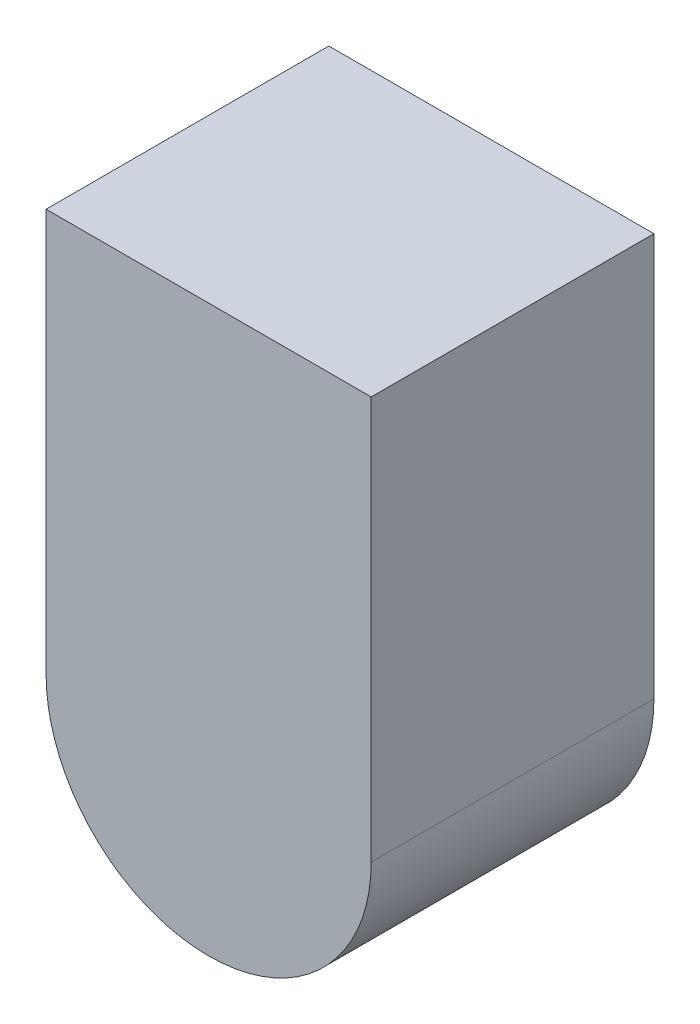
ISO-10303-21;
HEADER;
FILE_DESCRIPTION(('STEP AP214'),'2;1');
FILE_NAME('part.step','',(''),(''),'','','');
FILE_SCHEMA(('AUTOMOTIVE_DESIGN { 1 0 10303 214 1 1 1 1 }'));
ENDSEC;
DATA;
#1=APPLICATION_CONTEXT('core data for automotive mechanical design processes');
#2=APPLICATION_PROTOCOL_DEFINITION('international standard','automotive_design',2000,#1);
#3=PRODUCT_CONTEXT('',#1,'mechanical');
#4=PRODUCT('Part','Part','',(#3));
#5=PRODUCT_RELATED_PRODUCT_CATEGORY('part','',(#4));
#6=PRODUCT_DEFINITION_FORMATION('','',#4);
#7=PRODUCT_DEFINITION_CONTEXT('part definition',#1,'design');
#8=PRODUCT_DEFINITION('design','',#6,#7);
#9=PRODUCT_DEFINITION_SHAPE('','',#8);
#10=(LENGTH_UNIT() NAMED_UNIT(*) SI_UNIT(.MILLI.,.METRE.));
#11=(NAMED_UNIT(*) PLANE_ANGLE_UNIT() SI_UNIT($,.RADIAN.));
#12=(NAMED_UNIT(*) SI_UNIT($,.STERADIAN.) SOLID_ANGLE_UNIT());
#13=UNCERTAINTY_MEASURE_WITH_UNIT(LENGTH_MEASURE(1.E-05),#10,'distance_accuracy_value','');
#14=(GEOMETRIC_REPRESENTATION_CONTEXT(3) GLOBAL_UNCERTAINTY_ASSIGNED_CONTEXT((#13)) GLOBAL_UNIT_ASSIGNED_CONTEXT((#10,
#11,#12)) REPRESENTATION_CONTEXT('',''));
#15=CARTESIAN_POINT('',(0.,0.,0.));
#16=DIRECTION('',(0.,0.,1.));
#17=DIRECTION('',(1.,0.,0.));
#18=AXIS2_PLACEMENT_3D('',#15,#16,#17);
#19=CARTESIAN_POINT('',(-0.249999999999999,2.8335265642716,0.));
#20=DIRECTION('',(0.,0.,1.));
#21=DIRECTION('',(0.,-1.,0.));
#22=AXIS2_PLACEMENT_3D('',#19,#20,#21);
#23=PLANE('',#22);
#24=DIRECTION('',(-1.,0.,0.));
#25=VECTOR('',#24,1.);
#26=CARTESIAN_POINT('',(-0.134999999999999,3.,0.));
#27=LINE('',#26,#25);
#28=CARTESIAN_POINT('',(-0.134999999999999,3.,0.));
#29=VERTEX_POINT('',#28);
#30=CARTESIAN_POINT('',(-0.364999999999999,3.,0.));
#31=VERTEX_POINT('',#30);
#32=EDGE_CURVE('E11',#29,#31,#27,.T.);
#33=ORIENTED_EDGE('',*,*,#32,.F.);
#34=DIRECTION('',(0.,1.,0.));
#35=VECTOR('',#34,1.);
#36=CARTESIAN_POINT('',(-0.134999999999999,2.715,0.));
#37=LINE('',#36,#35);
#38=CARTESIAN_POINT('',(-0.134999999999999,2.715,0.));
#39=VERTEX_POINT('',#38);
#40=EDGE_CURVE('E24',#39,#29,#37,.T.);
#41=ORIENTED_EDGE('',*,*,#40,.F.);
#42=CARTESIAN_POINT('',(-0.249999999999999,2.715,0.));
#43=DIRECTION('',(0.,0.,1.));
#44=DIRECTION('',(-1.,0.,0.));
#45=AXIS2_PLACEMENT_3D('',#42,#43,#44);
#46=CIRCLE('',#45,0.115);
#47=CARTESIAN_POINT('',(-0.364999999999999,2.715,0.));
#48=VERTEX_POINT('',#47);
#49=EDGE_CURVE('E85',#48,#39,#46,.T.);
#50=ORIENTED_EDGE('',*,*,#49,.F.);
#51=DIRECTION('',(0.,-1.,0.));
#52=VECTOR('',#51,1.);
#53=CARTESIAN_POINT('',(-0.364999999999999,3.,0.));
#54=LINE('',#53,#52);
#55=EDGE_CURVE('E82',#31,#48,#54,.T.);
#56=ORIENTED_EDGE('',*,*,#55,.F.);
#57=EDGE_LOOP('',(#33,#41,#50,#56));
#58=FACE_BOUND('',#57,.T.);
#59=ADVANCED_FACE('F17',(#58),#23,.F.);
#60=CARTESIAN_POINT('',(-0.364999999999999,3.,0.));
#61=DIRECTION('',(-1.,0.,0.));
#62=DIRECTION('',(0.,-1.,0.));
#63=AXIS2_PLACEMENT_3D('',#60,#61,#62);
#64=PLANE('',#63);
#65=ORIENTED_EDGE('',*,*,#55,.T.);
#66=DIRECTION('',(0.,0.,1.));
#67=VECTOR('',#66,1.);
#68=CARTESIAN_POINT('',(-0.364999999999999,2.715,0.));
#69=LINE('',#68,#67);
#70=CARTESIAN_POINT('',(-0.364999999999999,2.715,0.2));
#71=VERTEX_POINT('',#70);
#72=EDGE_CURVE('E80',#48,#71,#69,.T.);
#73=ORIENTED_EDGE('',*,*,#72,.T.);
#74=DIRECTION('',(0.,-1.,0.));
#75=VECTOR('',#74,1.);
#76=CARTESIAN_POINT('',(-0.364999999999999,3.,0.2));
#77=LINE('',#76,#75);
#78=CARTESIAN_POINT('',(-0.364999999999999,3.,0.2));
#79=VERTEX_POINT('',#78);
#80=EDGE_CURVE('E78',#79,#71,#77,.T.);
#81=ORIENTED_EDGE('',*,*,#80,.F.);
#82=DIRECTION('',(0.,0.,-1.));
#83=VECTOR('',#82,1.);
#84=CARTESIAN_POINT('',(-0.364999999999999,3.,0.));
#85=LINE('',#84,#83);
#86=EDGE_CURVE('E71',#79,#31,#85,.T.);
#87=ORIENTED_EDGE('',*,*,#86,.T.);
#88=EDGE_LOOP('',(#65,#73,#81,#87));
#89=FACE_BOUND('',#88,.T.);
#90=ADVANCED_FACE('F91',(#89),#64,.T.);
#91=CARTESIAN_POINT('',(-0.249999999999999,2.715,0.));
#92=DIRECTION('',(0.,0.,1.));
#93=DIRECTION('',(-1.,0.,0.));
#94=AXIS2_PLACEMENT_3D('',#91,#92,#93);
#95=CYLINDRICAL_SURFACE('',#94,0.115);
#96=ORIENTED_EDGE('',*,*,#49,.T.);
#97=DIRECTION('',(0.,0.,1.));
#98=VECTOR('',#97,1.);
#99=CARTESIAN_POINT('',(-0.134999999999999,2.715,0.));
#100=LINE('',#99,#98);
#101=CARTESIAN_POINT('',(-0.134999999999999,2.715,0.2));
#102=VERTEX_POINT('',#101);
#103=EDGE_CURVE('E75',#39,#102,#100,.T.);
#104=ORIENTED_EDGE('',*,*,#103,.T.);
#105=CARTESIAN_POINT('',(-0.249999999999999,2.715,0.2));
#106=DIRECTION('',(0.,0.,1.));
#107=DIRECTION('',(-1.,0.,0.));
#108=AXIS2_PLACEMENT_3D('',#105,#106,#107);
#109=CIRCLE('',#108,0.115);
#110=EDGE_CURVE('E59',#71,#102,#109,.T.);
#111=ORIENTED_EDGE('',*,*,#110,.F.);
#112=ORIENTED_EDGE('',*,*,#72,.F.);
#113=EDGE_LOOP('',(#96,#104,#111,#112));
#114=FACE_BOUND('',#113,.T.);
#115=ADVANCED_FACE('F89',(#114),#95,.T.);
#116=CARTESIAN_POINT('',(-0.134999999999999,2.715,0.));
#117=DIRECTION('',(1.,0.,0.));
#118=DIRECTION('',(0.,1.,0.));
#119=AXIS2_PLACEMENT_3D('',#116,#117,#118);
#120=PLANE('',#119);
#121=ORIENTED_EDGE('',*,*,#40,.T.);
#122=DIRECTION('',(0.,0.,1.));
#123=VECTOR('',#122,1.);
#124=CARTESIAN_POINT('',(-0.134999999999999,3.,0.));
#125=LINE('',#124,#123);
#126=CARTESIAN_POINT('',(-0.134999999999999,3.,0.2));
#127=VERTEX_POINT('',#126);
#128=EDGE_CURVE('E53',#29,#127,#125,.T.);
#129=ORIENTED_EDGE('',*,*,#128,.T.);
#130=DIRECTION('',(0.,1.,0.));
#131=VECTOR('',#130,1.);
#132=CARTESIAN_POINT('',(-0.134999999999999,2.715,0.2));
#133=LINE('',#132,#131);
#134=EDGE_CURVE('E57',#102,#127,#133,.T.);
#135=ORIENTED_EDGE('',*,*,#134,.F.);
#136=ORIENTED_EDGE('',*,*,#103,.F.);
#137=EDGE_LOOP('',(#121,#129,#135,#136));
#138=FACE_BOUND('',#137,.T.);
#139=ADVANCED_FACE('F55',(#138),#120,.T.);
#140=CARTESIAN_POINT('',(3.,3.,0.));
#141=DIRECTION('',(0.,1.,0.));
#142=DIRECTION('',(-1.,0.,0.));
#143=AXIS2_PLACEMENT_3D('',#140,#141,#142);
#144=PLANE('',#143);
#145=ORIENTED_EDGE('',*,*,#86,.F.);
#146=DIRECTION('',(-1.,0.,0.));
#147=VECTOR('',#146,1.);
#148=CARTESIAN_POINT('',(1.375,3.,0.2));
#149=LINE('',#148,#147);
#150=EDGE_CURVE('E66',#127,#79,#149,.T.);
#151=ORIENTED_EDGE('',*,*,#150,.F.);
#152=ORIENTED_EDGE('',*,*,#128,.F.);
#153=ORIENTED_EDGE('',*,*,#32,.T.);
#154=EDGE_LOOP('',(#145,#151,#152,#153));
#155=FACE_BOUND('',#154,.T.);
#156=ADVANCED_FACE('F69',(#155),#144,.T.);
#157=CARTESIAN_POINT('',(-0.249999999999999,2.8335240809167,0.2));
#158=DIRECTION('',(0.,0.,1.));
#159=DIRECTION('',(1.,0.,0.));
#160=AXIS2_PLACEMENT_3D('',#157,#158,#159);
#161=PLANE('',#160);
#162=ORIENTED_EDGE('',*,*,#134,.T.);
#163=ORIENTED_EDGE('',*,*,#150,.T.);
#164=ORIENTED_EDGE('',*,*,#80,.T.);
#165=ORIENTED_EDGE('',*,*,#110,.T.);
#166=EDGE_LOOP('',(#162,#163,#164,#165));
#167=FACE_BOUND('',#166,.T.);
#168=ADVANCED_FACE('F64',(#167),#161,.T.);
#169=CLOSED_SHELL('',(#59,#90,#115,#139,#156,#168));
#170=MANIFOLD_SOLID_BREP('B1',#169);
#171=ADVANCED_BREP_SHAPE_REPRESENTATION('',(#18,#170),#14);
#172=SHAPE_DEFINITION_REPRESENTATION(#9,#171);
ENDSEC;
END-ISO-10303-21;
